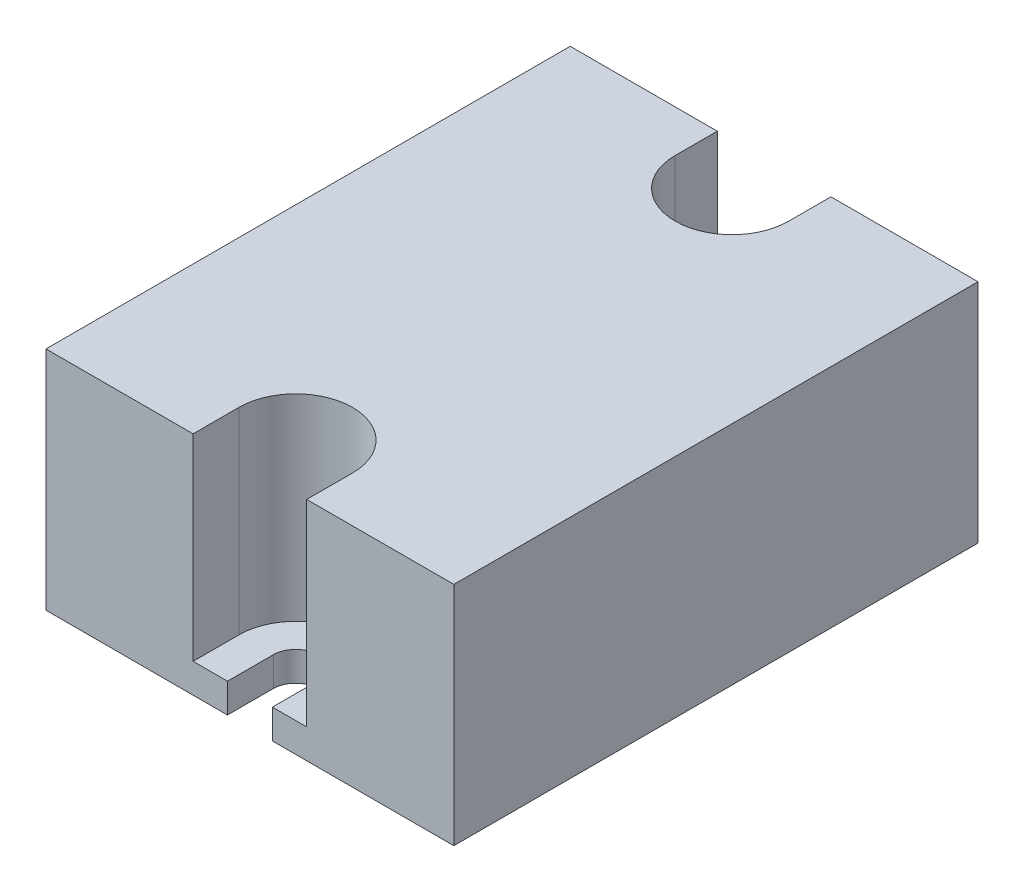
ISO-10303-21;
HEADER;
FILE_DESCRIPTION(('STEP AP214'),'2;1');
FILE_NAME('part.step','',(''),(''),'','','');
FILE_SCHEMA(('AUTOMOTIVE_DESIGN { 1 0 10303 214 1 1 1 1 }'));
ENDSEC;
DATA;
#1=APPLICATION_CONTEXT('core data for automotive mechanical design processes');
#2=APPLICATION_PROTOCOL_DEFINITION('international standard','automotive_design',2000,#1);
#3=PRODUCT_CONTEXT('',#1,'mechanical');
#4=PRODUCT('Part','Part','',(#3));
#5=PRODUCT_RELATED_PRODUCT_CATEGORY('part','',(#4));
#6=PRODUCT_DEFINITION_FORMATION('','',#4);
#7=PRODUCT_DEFINITION_CONTEXT('part definition',#1,'design');
#8=PRODUCT_DEFINITION('design','',#6,#7);
#9=PRODUCT_DEFINITION_SHAPE('','',#8);
#10=(LENGTH_UNIT() NAMED_UNIT(*) SI_UNIT(.MILLI.,.METRE.));
#11=(NAMED_UNIT(*) PLANE_ANGLE_UNIT() SI_UNIT($,.RADIAN.));
#12=(NAMED_UNIT(*) SI_UNIT($,.STERADIAN.) SOLID_ANGLE_UNIT());
#13=UNCERTAINTY_MEASURE_WITH_UNIT(LENGTH_MEASURE(1.E-05),#10,'distance_accuracy_value','');
#14=(GEOMETRIC_REPRESENTATION_CONTEXT(3) GLOBAL_UNCERTAINTY_ASSIGNED_CONTEXT((#13)) GLOBAL_UNIT_ASSIGNED_CONTEXT((#10,
#11,#12)) REPRESENTATION_CONTEXT('',''));
#15=CARTESIAN_POINT('',(0.,0.,0.));
#16=DIRECTION('',(0.,0.,1.));
#17=DIRECTION('',(1.,0.,0.));
#18=AXIS2_PLACEMENT_3D('',#15,#16,#17);
#19=CARTESIAN_POINT('',(22.25,3.19999999999998,-4.99999999999995));
#20=DIRECTION('',(0.,1.,0.));
#21=DIRECTION('',(0.,0.,1.));
#22=AXIS2_PLACEMENT_3D('',#19,#20,#21);
#23=PLANE('',#22);
#24=DIRECTION('',(0.,0.,-1.));
#25=VECTOR('',#24,1.);
#26=CARTESIAN_POINT('',(16.05,3.19999999999998,-57.2));
#27=LINE('',#26,#25);
#28=CARTESIAN_POINT('',(16.05,3.20000000000001,-52.6));
#29=VERTEX_POINT('',#28);
#30=CARTESIAN_POINT('',(16.05,3.19999999999998,-57.2));
#31=VERTEX_POINT('',#30);
#32=EDGE_CURVE('E53',#29,#31,#27,.T.);
#33=ORIENTED_EDGE('',*,*,#32,.F.);
#34=CARTESIAN_POINT('',(22.25,3.20000000000001,-52.5999999999999));
#35=DIRECTION('',(0.,-1.,0.));
#36=DIRECTION('',(0.,0.,1.));
#37=AXIS2_PLACEMENT_3D('',#34,#35,#36);
#38=CIRCLE('',#37,6.2);
#39=CARTESIAN_POINT('',(28.45,3.19999999999998,-52.6));
#40=VERTEX_POINT('',#39);
#41=EDGE_CURVE('E57',#40,#29,#38,.T.);
#42=ORIENTED_EDGE('',*,*,#41,.F.);
#43=DIRECTION('',(0.,0.,1.));
#44=VECTOR('',#43,1.);
#45=CARTESIAN_POINT('',(28.45,3.20000000000001,-57.2));
#46=LINE('',#45,#44);
#47=CARTESIAN_POINT('',(28.45,3.20000000000001,-57.2));
#48=VERTEX_POINT('',#47);
#49=EDGE_CURVE('E266',#48,#40,#46,.T.);
#50=ORIENTED_EDGE('',*,*,#49,.F.);
#51=DIRECTION('',(-1.,0.,0.));
#52=VECTOR('',#51,1.);
#53=CARTESIAN_POINT('',(44.5,3.19999999999998,-57.2));
#54=LINE('',#53,#52);
#55=EDGE_CURVE('E196',#48,#31,#54,.T.);
#56=ORIENTED_EDGE('',*,*,#55,.T.);
#57=EDGE_LOOP('',(#33,#42,#50,#56));
#58=FACE_BOUND('',#57,.T.);
#59=CARTESIAN_POINT('',(22.25,3.20000000000001,-52.5999999999999));
#60=DIRECTION('',(0.,1.,0.));
#61=DIRECTION('',(0.,0.,1.));
#62=AXIS2_PLACEMENT_3D('',#59,#60,#61);
#63=CIRCLE('',#62,2.45);
#64=CARTESIAN_POINT('',(22.25,3.20000000000001,-50.1499999999999));
#65=VERTEX_POINT('',#64);
#66=EDGE_CURVE('E177',#65,#65,#63,.T.);
#67=ORIENTED_EDGE('',*,*,#66,.F.);
#68=EDGE_LOOP('',(#67));
#69=FACE_BOUND('',#68,.T.);
#70=ADVANCED_FACE('F38',(#58,#69),#23,.T.);
#71=DIRECTION('',(0.,0.,1.));
#72=VECTOR('',#71,1.);
#73=CARTESIAN_POINT('',(28.45,3.19999999999998,0.));
#74=LINE('',#73,#72);
#75=CARTESIAN_POINT('',(28.45,3.20000000000001,-5.));
#76=VERTEX_POINT('',#75);
#77=CARTESIAN_POINT('',(28.45,3.19999999999998,0.));
#78=VERTEX_POINT('',#77);
#79=EDGE_CURVE('E260',#76,#78,#74,.T.);
#80=ORIENTED_EDGE('',*,*,#79,.F.);
#81=CARTESIAN_POINT('',(22.25,3.19999999999998,-4.99999999999995));
#82=DIRECTION('',(0.,-1.,0.));
#83=DIRECTION('',(0.,0.,-1.));
#84=AXIS2_PLACEMENT_3D('',#81,#82,#83);
#85=CIRCLE('',#84,6.2);
#86=CARTESIAN_POINT('',(16.05,3.19999999999998,-4.99999999999995));
#87=VERTEX_POINT('',#86);
#88=EDGE_CURVE('E258',#87,#76,#85,.T.);
#89=ORIENTED_EDGE('',*,*,#88,.F.);
#90=DIRECTION('',(0.,0.,-1.));
#91=VECTOR('',#90,1.);
#92=CARTESIAN_POINT('',(16.05,3.20000000000001,0.));
#93=LINE('',#92,#91);
#94=CARTESIAN_POINT('',(16.05,3.20000000000001,0.));
#95=VERTEX_POINT('',#94);
#96=EDGE_CURVE('E256',#95,#87,#93,.T.);
#97=ORIENTED_EDGE('',*,*,#96,.F.);
#98=DIRECTION('',(1.,0.,0.));
#99=VECTOR('',#98,1.);
#100=CARTESIAN_POINT('',(0.,3.20000000000001,0.));
#101=LINE('',#100,#99);
#102=CARTESIAN_POINT('',(19.8,3.20000000000001,0.));
#103=VERTEX_POINT('',#102);
#104=EDGE_CURVE('E173',#95,#103,#101,.T.);
#105=ORIENTED_EDGE('',*,*,#104,.T.);
#106=DIRECTION('',(0.,0.,-1.));
#107=VECTOR('',#106,1.);
#108=CARTESIAN_POINT('',(19.8,3.20000000000001,0.));
#109=LINE('',#108,#107);
#110=CARTESIAN_POINT('',(19.8,3.20000000000001,-4.99999999999995));
#111=VERTEX_POINT('',#110);
#112=EDGE_CURVE('E187',#103,#111,#109,.T.);
#113=ORIENTED_EDGE('',*,*,#112,.T.);
#114=CARTESIAN_POINT('',(22.25,3.19999999999998,-4.99999999999995));
#115=DIRECTION('',(0.,-1.,0.));
#116=DIRECTION('',(0.,0.,1.));
#117=AXIS2_PLACEMENT_3D('',#114,#115,#116);
#118=CIRCLE('',#117,2.45);
#119=CARTESIAN_POINT('',(24.7,3.19999999999998,-4.99999999999995));
#120=VERTEX_POINT('',#119);
#121=EDGE_CURVE('E190',#111,#120,#118,.T.);
#122=ORIENTED_EDGE('',*,*,#121,.T.);
#123=DIRECTION('',(0.,0.,1.));
#124=VECTOR('',#123,1.);
#125=CARTESIAN_POINT('',(24.7,3.20000000000001,0.));
#126=LINE('',#125,#124);
#127=CARTESIAN_POINT('',(24.7,3.20000000000001,0.));
#128=VERTEX_POINT('',#127);
#129=EDGE_CURVE('E192',#120,#128,#126,.T.);
#130=ORIENTED_EDGE('',*,*,#129,.T.);
#131=DIRECTION('',(1.,0.,0.));
#132=VECTOR('',#131,1.);
#133=CARTESIAN_POINT('',(44.5,3.20000000000001,0.));
#134=LINE('',#133,#132);
#135=EDGE_CURVE('E194',#128,#78,#134,.T.);
#136=ORIENTED_EDGE('',*,*,#135,.T.);
#137=EDGE_LOOP('',(#80,#89,#97,#105,#113,#122,#130,#136));
#138=FACE_BOUND('',#137,.T.);
#139=ADVANCED_FACE('F254',(#138),#23,.T.);
#140=CARTESIAN_POINT('',(22.25,0.,-5.));
#141=DIRECTION('',(0.,1.,0.));
#142=DIRECTION('',(0.,0.,1.));
#143=AXIS2_PLACEMENT_3D('',#140,#141,#142);
#144=PLANE('',#143);
#145=DIRECTION('',(0.,0.,1.));
#146=VECTOR('',#145,1.);
#147=CARTESIAN_POINT('',(0.,0.,0.));
#148=LINE('',#147,#146);
#149=CARTESIAN_POINT('',(0.,0.,-57.2));
#150=VERTEX_POINT('',#149);
#151=CARTESIAN_POINT('',(0.,0.,0.));
#152=VERTEX_POINT('',#151);
#153=EDGE_CURVE('E184',#150,#152,#148,.T.);
#154=ORIENTED_EDGE('',*,*,#153,.F.);
#155=DIRECTION('',(-1.,0.,0.));
#156=VECTOR('',#155,1.);
#157=CARTESIAN_POINT('',(0.,0.,-57.2));
#158=LINE('',#157,#156);
#159=CARTESIAN_POINT('',(44.5,0.,-57.2));
#160=VERTEX_POINT('',#159);
#161=EDGE_CURVE('E188',#160,#150,#158,.T.);
#162=ORIENTED_EDGE('',*,*,#161,.F.);
#163=DIRECTION('',(0.,0.,-1.));
#164=VECTOR('',#163,1.);
#165=CARTESIAN_POINT('',(44.5,0.,0.));
#166=LINE('',#165,#164);
#167=CARTESIAN_POINT('',(44.5,0.,0.));
#168=VERTEX_POINT('',#167);
#169=EDGE_CURVE('E211',#168,#160,#166,.T.);
#170=ORIENTED_EDGE('',*,*,#169,.F.);
#171=DIRECTION('',(1.,0.,0.));
#172=VECTOR('',#171,1.);
#173=CARTESIAN_POINT('',(44.5,0.,0.));
#174=LINE('',#173,#172);
#175=CARTESIAN_POINT('',(24.7,0.,0.));
#176=VERTEX_POINT('',#175);
#177=EDGE_CURVE('E209',#176,#168,#174,.T.);
#178=ORIENTED_EDGE('',*,*,#177,.F.);
#179=DIRECTION('',(0.,0.,1.));
#180=VECTOR('',#179,1.);
#181=CARTESIAN_POINT('',(24.7,0.,0.));
#182=LINE('',#181,#180);
#183=CARTESIAN_POINT('',(24.7,0.,-4.99999999999995));
#184=VERTEX_POINT('',#183);
#185=EDGE_CURVE('E207',#184,#176,#182,.T.);
#186=ORIENTED_EDGE('',*,*,#185,.F.);
#187=CARTESIAN_POINT('',(22.25,0.,-5.));
#188=DIRECTION('',(0.,-1.,0.));
#189=DIRECTION('',(0.,0.,1.));
#190=AXIS2_PLACEMENT_3D('',#187,#188,#189);
#191=CIRCLE('',#190,2.45);
#192=CARTESIAN_POINT('',(19.8,0.,-5.));
#193=VERTEX_POINT('',#192);
#194=EDGE_CURVE('E205',#193,#184,#191,.T.);
#195=ORIENTED_EDGE('',*,*,#194,.F.);
#196=DIRECTION('',(0.,0.,-1.));
#197=VECTOR('',#196,1.);
#198=CARTESIAN_POINT('',(19.8,0.,0.));
#199=LINE('',#198,#197);
#200=CARTESIAN_POINT('',(19.8,0.,0.));
#201=VERTEX_POINT('',#200);
#202=EDGE_CURVE('E203',#201,#193,#199,.T.);
#203=ORIENTED_EDGE('',*,*,#202,.F.);
#204=DIRECTION('',(1.,0.,0.));
#205=VECTOR('',#204,1.);
#206=CARTESIAN_POINT('',(0.,0.,0.));
#207=LINE('',#206,#205);
#208=EDGE_CURVE('E201',#152,#201,#207,.T.);
#209=ORIENTED_EDGE('',*,*,#208,.F.);
#210=EDGE_LOOP('',(#154,#162,#170,#178,#186,#195,#203,#209));
#211=FACE_BOUND('',#210,.T.);
#212=CARTESIAN_POINT('',(22.25,0.,-52.6));
#213=DIRECTION('',(0.,1.,0.));
#214=DIRECTION('',(0.,0.,1.));
#215=AXIS2_PLACEMENT_3D('',#212,#213,#214);
#216=CIRCLE('',#215,2.45);
#217=CARTESIAN_POINT('',(22.25,0.,-50.15));
#218=VERTEX_POINT('',#217);
#219=EDGE_CURVE('E174',#218,#218,#216,.T.);
#220=ORIENTED_EDGE('',*,*,#219,.T.);
#221=EDGE_LOOP('',(#220));
#222=FACE_BOUND('',#221,.T.);
#223=ADVANCED_FACE('F240',(#211,#222),#144,.F.);
#224=CARTESIAN_POINT('',(0.,3.20000000000001,0.));
#225=DIRECTION('',(1.,0.,0.));
#226=DIRECTION('',(0.,0.,-1.));
#227=AXIS2_PLACEMENT_3D('',#224,#225,#226);
#228=PLANE('',#227);
#229=ORIENTED_EDGE('',*,*,#153,.T.);
#230=DIRECTION('',(0.,-1.,0.));
#231=VECTOR('',#230,1.);
#232=CARTESIAN_POINT('',(0.,3.20000000000001,0.));
#233=LINE('',#232,#231);
#234=CARTESIAN_POINT('',(0.,24.7,0.));
#235=VERTEX_POINT('',#234);
#236=EDGE_CURVE('E11',#235,#152,#233,.T.);
#237=ORIENTED_EDGE('',*,*,#236,.F.);
#238=DIRECTION('',(0.,0.,1.));
#239=VECTOR('',#238,1.);
#240=CARTESIAN_POINT('',(0.,24.7,0.));
#241=LINE('',#240,#239);
#242=CARTESIAN_POINT('',(0.,24.7,-57.2));
#243=VERTEX_POINT('',#242);
#244=EDGE_CURVE('E167',#243,#235,#241,.T.);
#245=ORIENTED_EDGE('',*,*,#244,.F.);
#246=DIRECTION('',(0.,-1.,0.));
#247=VECTOR('',#246,1.);
#248=CARTESIAN_POINT('',(0.,3.19999999999998,-57.2));
#249=LINE('',#248,#247);
#250=EDGE_CURVE('E198',#243,#150,#249,.T.);
#251=ORIENTED_EDGE('',*,*,#250,.T.);
#252=EDGE_LOOP('',(#229,#237,#245,#251));
#253=FACE_BOUND('',#252,.T.);
#254=ADVANCED_FACE('F40',(#253),#228,.F.);
#255=CARTESIAN_POINT('',(0.,3.20000000000001,0.));
#256=DIRECTION('',(0.,0.,-1.));
#257=DIRECTION('',(-1.,0.,0.));
#258=AXIS2_PLACEMENT_3D('',#255,#256,#257);
#259=PLANE('',#258);
#260=ORIENTED_EDGE('',*,*,#208,.T.);
#261=DIRECTION('',(0.,-1.,0.));
#262=VECTOR('',#261,1.);
#263=CARTESIAN_POINT('',(19.8,3.20000000000001,0.));
#264=LINE('',#263,#262);
#265=EDGE_CURVE('E46',#103,#201,#264,.T.);
#266=ORIENTED_EDGE('',*,*,#265,.F.);
#267=ORIENTED_EDGE('',*,*,#104,.F.);
#268=DIRECTION('',(0.,-1.,0.));
#269=VECTOR('',#268,1.);
#270=CARTESIAN_POINT('',(16.05,24.7,0.));
#271=LINE('',#270,#269);
#272=CARTESIAN_POINT('',(16.05,24.7,0.));
#273=VERTEX_POINT('',#272);
#274=EDGE_CURVE('E154',#273,#95,#271,.T.);
#275=ORIENTED_EDGE('',*,*,#274,.F.);
#276=DIRECTION('',(1.,0.,0.));
#277=VECTOR('',#276,1.);
#278=CARTESIAN_POINT('',(0.,24.7,0.));
#279=LINE('',#278,#277);
#280=EDGE_CURVE('E160',#235,#273,#279,.T.);
#281=ORIENTED_EDGE('',*,*,#280,.F.);
#282=ORIENTED_EDGE('',*,*,#236,.T.);
#283=EDGE_LOOP('',(#260,#266,#267,#275,#281,#282));
#284=FACE_BOUND('',#283,.T.);
#285=ADVANCED_FACE('F171',(#284),#259,.F.);
#286=CARTESIAN_POINT('',(19.8,3.20000000000001,0.));
#287=DIRECTION('',(-1.,0.,0.));
#288=DIRECTION('',(0.,0.,1.));
#289=AXIS2_PLACEMENT_3D('',#286,#287,#288);
#290=PLANE('',#289);
#291=ORIENTED_EDGE('',*,*,#202,.T.);
#292=DIRECTION('',(0.,-1.,0.));
#293=VECTOR('',#292,1.);
#294=CARTESIAN_POINT('',(19.8,3.20000000000001,-4.99999999999995));
#295=LINE('',#294,#293);
#296=EDGE_CURVE('E229',#111,#193,#295,.T.);
#297=ORIENTED_EDGE('',*,*,#296,.F.);
#298=ORIENTED_EDGE('',*,*,#112,.F.);
#299=ORIENTED_EDGE('',*,*,#265,.T.);
#300=EDGE_LOOP('',(#291,#297,#298,#299));
#301=FACE_BOUND('',#300,.T.);
#302=ADVANCED_FACE('F235',(#301),#290,.F.);
#303=CARTESIAN_POINT('',(22.25,3.19999999999998,-4.99999999999995));
#304=DIRECTION('',(0.,-1.,0.));
#305=DIRECTION('',(0.,0.,-1.));
#306=AXIS2_PLACEMENT_3D('',#303,#304,#305);
#307=CYLINDRICAL_SURFACE('',#306,2.45);
#308=ORIENTED_EDGE('',*,*,#194,.T.);
#309=DIRECTION('',(0.,-1.,0.));
#310=VECTOR('',#309,1.);
#311=CARTESIAN_POINT('',(24.7,3.19999999999998,-4.99999999999995));
#312=LINE('',#311,#310);
#313=EDGE_CURVE('E226',#120,#184,#312,.T.);
#314=ORIENTED_EDGE('',*,*,#313,.F.);
#315=ORIENTED_EDGE('',*,*,#121,.F.);
#316=ORIENTED_EDGE('',*,*,#296,.T.);
#317=EDGE_LOOP('',(#308,#314,#315,#316));
#318=FACE_BOUND('',#317,.T.);
#319=ADVANCED_FACE('F246',(#318),#307,.F.);
#320=CARTESIAN_POINT('',(24.7,3.20000000000001,0.));
#321=DIRECTION('',(1.,0.,0.));
#322=DIRECTION('',(0.,0.,-1.));
#323=AXIS2_PLACEMENT_3D('',#320,#321,#322);
#324=PLANE('',#323);
#325=ORIENTED_EDGE('',*,*,#185,.T.);
#326=DIRECTION('',(0.,-1.,0.));
#327=VECTOR('',#326,1.);
#328=CARTESIAN_POINT('',(24.7,3.20000000000001,0.));
#329=LINE('',#328,#327);
#330=EDGE_CURVE('E223',#128,#176,#329,.T.);
#331=ORIENTED_EDGE('',*,*,#330,.F.);
#332=ORIENTED_EDGE('',*,*,#129,.F.);
#333=ORIENTED_EDGE('',*,*,#313,.T.);
#334=EDGE_LOOP('',(#325,#331,#332,#333));
#335=FACE_BOUND('',#334,.T.);
#336=ADVANCED_FACE('F250',(#335),#324,.F.);
#337=CARTESIAN_POINT('',(44.5,3.20000000000001,0.));
#338=DIRECTION('',(0.,0.,-1.));
#339=DIRECTION('',(-1.,0.,0.));
#340=AXIS2_PLACEMENT_3D('',#337,#338,#339);
#341=PLANE('',#340);
#342=ORIENTED_EDGE('',*,*,#177,.T.);
#343=DIRECTION('',(0.,-1.,0.));
#344=VECTOR('',#343,1.);
#345=CARTESIAN_POINT('',(44.5,3.20000000000001,0.));
#346=LINE('',#345,#344);
#347=CARTESIAN_POINT('',(44.5,24.7,0.));
#348=VERTEX_POINT('',#347);
#349=EDGE_CURVE('E220',#348,#168,#346,.T.);
#350=ORIENTED_EDGE('',*,*,#349,.F.);
#351=DIRECTION('',(1.,0.,0.));
#352=VECTOR('',#351,1.);
#353=CARTESIAN_POINT('',(44.5,24.7,0.));
#354=LINE('',#353,#352);
#355=CARTESIAN_POINT('',(28.45,24.7,0.));
#356=VERTEX_POINT('',#355);
#357=EDGE_CURVE('E294',#356,#348,#354,.T.);
#358=ORIENTED_EDGE('',*,*,#357,.F.);
#359=DIRECTION('',(0.,-1.,0.));
#360=VECTOR('',#359,1.);
#361=CARTESIAN_POINT('',(28.45,24.7,0.));
#362=LINE('',#361,#360);
#363=EDGE_CURVE('E282',#356,#78,#362,.T.);
#364=ORIENTED_EDGE('',*,*,#363,.T.);
#365=ORIENTED_EDGE('',*,*,#135,.F.);
#366=ORIENTED_EDGE('',*,*,#330,.T.);
#367=EDGE_LOOP('',(#342,#350,#358,#364,#365,#366));
#368=FACE_BOUND('',#367,.T.);
#369=ADVANCED_FACE('F327',(#368),#341,.F.);
#370=CARTESIAN_POINT('',(44.5,3.20000000000001,0.));
#371=DIRECTION('',(-1.,0.,0.));
#372=DIRECTION('',(0.,0.,1.));
#373=AXIS2_PLACEMENT_3D('',#370,#371,#372);
#374=PLANE('',#373);
#375=ORIENTED_EDGE('',*,*,#169,.T.);
#376=DIRECTION('',(0.,-1.,0.));
#377=VECTOR('',#376,1.);
#378=CARTESIAN_POINT('',(44.5,3.19999999999998,-57.2));
#379=LINE('',#378,#377);
#380=CARTESIAN_POINT('',(44.5,24.7,-57.2));
#381=VERTEX_POINT('',#380);
#382=EDGE_CURVE('E217',#381,#160,#379,.T.);
#383=ORIENTED_EDGE('',*,*,#382,.F.);
#384=DIRECTION('',(0.,0.,-1.));
#385=VECTOR('',#384,1.);
#386=CARTESIAN_POINT('',(44.5,24.7,0.));
#387=LINE('',#386,#385);
#388=EDGE_CURVE('E299',#348,#381,#387,.T.);
#389=ORIENTED_EDGE('',*,*,#388,.F.);
#390=ORIENTED_EDGE('',*,*,#349,.T.);
#391=EDGE_LOOP('',(#375,#383,#389,#390));
#392=FACE_BOUND('',#391,.T.);
#393=ADVANCED_FACE('F317',(#392),#374,.F.);
#394=CARTESIAN_POINT('',(0.,3.19999999999998,-57.2));
#395=DIRECTION('',(0.,0.,1.));
#396=DIRECTION('',(1.,0.,0.));
#397=AXIS2_PLACEMENT_3D('',#394,#395,#396);
#398=PLANE('',#397);
#399=ORIENTED_EDGE('',*,*,#161,.T.);
#400=ORIENTED_EDGE('',*,*,#250,.F.);
#401=DIRECTION('',(-1.,0.,0.));
#402=VECTOR('',#401,1.);
#403=CARTESIAN_POINT('',(0.,24.7,-57.2));
#404=LINE('',#403,#402);
#405=CARTESIAN_POINT('',(16.05,24.7,-57.2));
#406=VERTEX_POINT('',#405);
#407=EDGE_CURVE('E309',#406,#243,#404,.T.);
#408=ORIENTED_EDGE('',*,*,#407,.F.);
#409=DIRECTION('',(0.,-1.,0.));
#410=VECTOR('',#409,1.);
#411=CARTESIAN_POINT('',(16.05,24.7,-57.2));
#412=LINE('',#411,#410);
#413=EDGE_CURVE('E270',#406,#31,#412,.T.);
#414=ORIENTED_EDGE('',*,*,#413,.T.);
#415=ORIENTED_EDGE('',*,*,#55,.F.);
#416=DIRECTION('',(0.,-1.,0.));
#417=VECTOR('',#416,1.);
#418=CARTESIAN_POINT('',(28.45,24.7,-57.2));
#419=LINE('',#418,#417);
#420=CARTESIAN_POINT('',(28.45,24.7,-57.2));
#421=VERTEX_POINT('',#420);
#422=EDGE_CURVE('E279',#421,#48,#419,.T.);
#423=ORIENTED_EDGE('',*,*,#422,.F.);
#424=DIRECTION('',(-1.,0.,0.));
#425=VECTOR('',#424,1.);
#426=CARTESIAN_POINT('',(44.5,24.7,-57.2));
#427=LINE('',#426,#425);
#428=EDGE_CURVE('E302',#381,#421,#427,.T.);
#429=ORIENTED_EDGE('',*,*,#428,.F.);
#430=ORIENTED_EDGE('',*,*,#382,.T.);
#431=EDGE_LOOP('',(#399,#400,#408,#414,#415,#423,#429,#430));
#432=FACE_BOUND('',#431,.T.);
#433=ADVANCED_FACE('F320',(#432),#398,.F.);
#434=CARTESIAN_POINT('',(22.25,3.20000000000001,-52.5999999999999));
#435=DIRECTION('',(0.,-1.,0.));
#436=DIRECTION('',(0.,0.,-1.));
#437=AXIS2_PLACEMENT_3D('',#434,#435,#436);
#438=CYLINDRICAL_SURFACE('',#437,2.45);
#439=ORIENTED_EDGE('',*,*,#66,.T.);
#440=EDGE_LOOP('',(#439));
#441=FACE_BOUND('',#440,.T.);
#442=ORIENTED_EDGE('',*,*,#219,.F.);
#443=EDGE_LOOP('',(#442));
#444=FACE_BOUND('',#443,.T.);
#445=ADVANCED_FACE('F344',(#441,#444),#438,.F.);
#446=CARTESIAN_POINT('',(16.05,24.7,0.));
#447=DIRECTION('',(-1.,0.,0.));
#448=DIRECTION('',(0.,0.,1.));
#449=AXIS2_PLACEMENT_3D('',#446,#447,#448);
#450=PLANE('',#449);
#451=ORIENTED_EDGE('',*,*,#96,.T.);
#452=DIRECTION('',(0.,-1.,0.));
#453=VECTOR('',#452,1.);
#454=CARTESIAN_POINT('',(16.05,24.7,-4.99999999999995));
#455=LINE('',#454,#453);
#456=CARTESIAN_POINT('',(16.05,24.7,-4.99999999999995));
#457=VERTEX_POINT('',#456);
#458=EDGE_CURVE('E156',#457,#87,#455,.T.);
#459=ORIENTED_EDGE('',*,*,#458,.F.);
#460=DIRECTION('',(0.,0.,-1.));
#461=VECTOR('',#460,1.);
#462=CARTESIAN_POINT('',(16.05,24.7,0.));
#463=LINE('',#462,#461);
#464=EDGE_CURVE('E149',#273,#457,#463,.T.);
#465=ORIENTED_EDGE('',*,*,#464,.F.);
#466=ORIENTED_EDGE('',*,*,#274,.T.);
#467=EDGE_LOOP('',(#451,#459,#465,#466));
#468=FACE_BOUND('',#467,.T.);
#469=ADVANCED_FACE('F152',(#468),#450,.F.);
#470=CARTESIAN_POINT('',(22.25,24.7,-4.99999999999995));
#471=DIRECTION('',(0.,-1.,0.));
#472=DIRECTION('',(0.,0.,-1.));
#473=AXIS2_PLACEMENT_3D('',#470,#471,#472);
#474=CYLINDRICAL_SURFACE('',#473,6.2);
#475=ORIENTED_EDGE('',*,*,#88,.T.);
#476=DIRECTION('',(0.,-1.,0.));
#477=VECTOR('',#476,1.);
#478=CARTESIAN_POINT('',(28.45,24.7,-5.));
#479=LINE('',#478,#477);
#480=CARTESIAN_POINT('',(28.45,24.7,-5.));
#481=VERTEX_POINT('',#480);
#482=EDGE_CURVE('E179',#481,#76,#479,.T.);
#483=ORIENTED_EDGE('',*,*,#482,.F.);
#484=CARTESIAN_POINT('',(22.25,24.7,-4.99999999999995));
#485=DIRECTION('',(0.,-1.,0.));
#486=DIRECTION('',(0.,0.,-1.));
#487=AXIS2_PLACEMENT_3D('',#484,#485,#486);
#488=CIRCLE('',#487,6.2);
#489=EDGE_CURVE('E159',#457,#481,#488,.T.);
#490=ORIENTED_EDGE('',*,*,#489,.F.);
#491=ORIENTED_EDGE('',*,*,#458,.T.);
#492=EDGE_LOOP('',(#475,#483,#490,#491));
#493=FACE_BOUND('',#492,.T.);
#494=ADVANCED_FACE('F292',(#493),#474,.F.);
#495=CARTESIAN_POINT('',(28.45,24.7,0.));
#496=DIRECTION('',(1.,0.,0.));
#497=DIRECTION('',(0.,0.,-1.));
#498=AXIS2_PLACEMENT_3D('',#495,#496,#497);
#499=PLANE('',#498);
#500=ORIENTED_EDGE('',*,*,#79,.T.);
#501=ORIENTED_EDGE('',*,*,#363,.F.);
#502=DIRECTION('',(0.,0.,1.));
#503=VECTOR('',#502,1.);
#504=CARTESIAN_POINT('',(28.45,24.7,0.));
#505=LINE('',#504,#503);
#506=EDGE_CURVE('E290',#481,#356,#505,.T.);
#507=ORIENTED_EDGE('',*,*,#506,.F.);
#508=ORIENTED_EDGE('',*,*,#482,.T.);
#509=EDGE_LOOP('',(#500,#501,#507,#508));
#510=FACE_BOUND('',#509,.T.);
#511=ADVANCED_FACE('F288',(#510),#499,.F.);
#512=CARTESIAN_POINT('',(28.45,24.7,-57.2));
#513=DIRECTION('',(1.,0.,0.));
#514=DIRECTION('',(0.,0.,-1.));
#515=AXIS2_PLACEMENT_3D('',#512,#513,#514);
#516=PLANE('',#515);
#517=ORIENTED_EDGE('',*,*,#49,.T.);
#518=DIRECTION('',(0.,-1.,0.));
#519=VECTOR('',#518,1.);
#520=CARTESIAN_POINT('',(28.45,24.7,-52.6));
#521=LINE('',#520,#519);
#522=CARTESIAN_POINT('',(28.45,24.7,-52.6));
#523=VERTEX_POINT('',#522);
#524=EDGE_CURVE('E276',#523,#40,#521,.T.);
#525=ORIENTED_EDGE('',*,*,#524,.F.);
#526=DIRECTION('',(0.,0.,1.));
#527=VECTOR('',#526,1.);
#528=CARTESIAN_POINT('',(28.45,24.7,-57.2));
#529=LINE('',#528,#527);
#530=EDGE_CURVE('E304',#421,#523,#529,.T.);
#531=ORIENTED_EDGE('',*,*,#530,.F.);
#532=ORIENTED_EDGE('',*,*,#422,.T.);
#533=EDGE_LOOP('',(#517,#525,#531,#532));
#534=FACE_BOUND('',#533,.T.);
#535=ADVANCED_FACE('F366',(#534),#516,.F.);
#536=CARTESIAN_POINT('',(22.25,24.7,-52.6));
#537=DIRECTION('',(0.,-1.,0.));
#538=DIRECTION('',(0.,0.,-1.));
#539=AXIS2_PLACEMENT_3D('',#536,#537,#538);
#540=CYLINDRICAL_SURFACE('',#539,6.2);
#541=ORIENTED_EDGE('',*,*,#41,.T.);
#542=DIRECTION('',(0.,-1.,0.));
#543=VECTOR('',#542,1.);
#544=CARTESIAN_POINT('',(16.05,24.7,-52.6));
#545=LINE('',#544,#543);
#546=CARTESIAN_POINT('',(16.05,24.7,-52.6));
#547=VERTEX_POINT('',#546);
#548=EDGE_CURVE('E273',#547,#29,#545,.T.);
#549=ORIENTED_EDGE('',*,*,#548,.F.);
#550=CARTESIAN_POINT('',(22.25,24.7,-52.6));
#551=DIRECTION('',(0.,-1.,0.));
#552=DIRECTION('',(0.,0.,1.));
#553=AXIS2_PLACEMENT_3D('',#550,#551,#552);
#554=CIRCLE('',#553,6.2);
#555=EDGE_CURVE('E306',#523,#547,#554,.T.);
#556=ORIENTED_EDGE('',*,*,#555,.F.);
#557=ORIENTED_EDGE('',*,*,#524,.T.);
#558=EDGE_LOOP('',(#541,#549,#556,#557));
#559=FACE_BOUND('',#558,.T.);
#560=ADVANCED_FACE('F369',(#559),#540,.F.);
#561=CARTESIAN_POINT('',(16.05,24.7,-57.2));
#562=DIRECTION('',(-1.,0.,0.));
#563=DIRECTION('',(0.,0.,1.));
#564=AXIS2_PLACEMENT_3D('',#561,#562,#563);
#565=PLANE('',#564);
#566=ORIENTED_EDGE('',*,*,#32,.T.);
#567=ORIENTED_EDGE('',*,*,#413,.F.);
#568=DIRECTION('',(0.,0.,-1.));
#569=VECTOR('',#568,1.);
#570=CARTESIAN_POINT('',(16.05,24.7,-57.2));
#571=LINE('',#570,#569);
#572=EDGE_CURVE('E308',#547,#406,#571,.T.);
#573=ORIENTED_EDGE('',*,*,#572,.F.);
#574=ORIENTED_EDGE('',*,*,#548,.T.);
#575=EDGE_LOOP('',(#566,#567,#573,#574));
#576=FACE_BOUND('',#575,.T.);
#577=ADVANCED_FACE('F373',(#576),#565,.F.);
#578=CARTESIAN_POINT('',(22.25,24.7,-4.99999999999995));
#579=DIRECTION('',(0.,-1.,0.));
#580=DIRECTION('',(0.,0.,-1.));
#581=AXIS2_PLACEMENT_3D('',#578,#579,#580);
#582=PLANE('',#581);
#583=ORIENTED_EDGE('',*,*,#280,.T.);
#584=ORIENTED_EDGE('',*,*,#464,.T.);
#585=ORIENTED_EDGE('',*,*,#489,.T.);
#586=ORIENTED_EDGE('',*,*,#506,.T.);
#587=ORIENTED_EDGE('',*,*,#357,.T.);
#588=ORIENTED_EDGE('',*,*,#388,.T.);
#589=ORIENTED_EDGE('',*,*,#428,.T.);
#590=ORIENTED_EDGE('',*,*,#530,.T.);
#591=ORIENTED_EDGE('',*,*,#555,.T.);
#592=ORIENTED_EDGE('',*,*,#572,.T.);
#593=ORIENTED_EDGE('',*,*,#407,.T.);
#594=ORIENTED_EDGE('',*,*,#244,.T.);
#595=EDGE_LOOP('',(#583,#584,#585,#586,#587,#588,#589,#590,#591,#592,#593,#594));
#596=FACE_BOUND('',#595,.T.);
#597=ADVANCED_FACE('F164',(#596),#582,.F.);
#598=CLOSED_SHELL('',(#70,#139,#223,#254,#285,#302,#319,#336,#369,#393,#433,#445,#469,#494,#511,
#535,#560,#577,#597));
#599=MANIFOLD_SOLID_BREP('B2',#598);
#600=ADVANCED_BREP_SHAPE_REPRESENTATION('',(#18,#599),#14);
#601=SHAPE_DEFINITION_REPRESENTATION(#9,#600);
ENDSEC;
END-ISO-10303-21;
